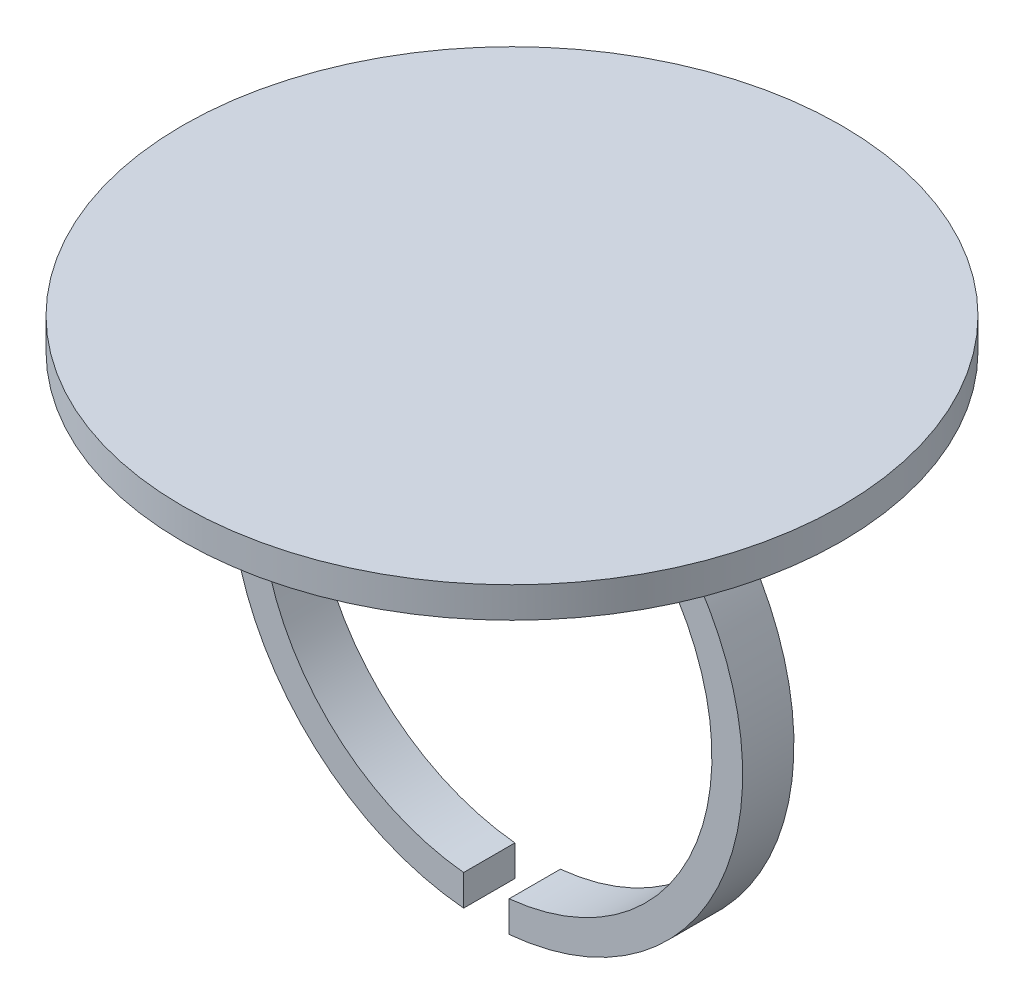
ISO-10303-21;
HEADER;
FILE_DESCRIPTION(('STEP AP214'),'2;1');
FILE_NAME('part.step','',(''),(''),'','','');
FILE_SCHEMA(('AUTOMOTIVE_DESIGN { 1 0 10303 214 1 1 1 1 }'));
ENDSEC;
DATA;
#1=APPLICATION_CONTEXT('core data for automotive mechanical design processes');
#2=APPLICATION_PROTOCOL_DEFINITION('international standard','automotive_design',2000,#1);
#3=PRODUCT_CONTEXT('',#1,'mechanical');
#4=PRODUCT('Part','Part','',(#3));
#5=PRODUCT_RELATED_PRODUCT_CATEGORY('part','',(#4));
#6=PRODUCT_DEFINITION_FORMATION('','',#4);
#7=PRODUCT_DEFINITION_CONTEXT('part definition',#1,'design');
#8=PRODUCT_DEFINITION('design','',#6,#7);
#9=PRODUCT_DEFINITION_SHAPE('','',#8);
#10=(LENGTH_UNIT() NAMED_UNIT(*) SI_UNIT(.MILLI.,.METRE.));
#11=(NAMED_UNIT(*) PLANE_ANGLE_UNIT() SI_UNIT($,.RADIAN.));
#12=(NAMED_UNIT(*) SI_UNIT($,.STERADIAN.) SOLID_ANGLE_UNIT());
#13=UNCERTAINTY_MEASURE_WITH_UNIT(LENGTH_MEASURE(1.E-05),#10,'distance_accuracy_value','');
#14=(GEOMETRIC_REPRESENTATION_CONTEXT(3) GLOBAL_UNCERTAINTY_ASSIGNED_CONTEXT((#13)) GLOBAL_UNIT_ASSIGNED_CONTEXT((#10,
#11,#12)) REPRESENTATION_CONTEXT('',''));
#15=CARTESIAN_POINT('',(0.,0.,0.));
#16=DIRECTION('',(0.,0.,1.));
#17=DIRECTION('',(1.,0.,0.));
#18=AXIS2_PLACEMENT_3D('',#15,#16,#17);
#19=CARTESIAN_POINT('',(0.,-22.,-2.5));
#20=DIRECTION('',(0.,0.,1.));
#21=DIRECTION('',(1.,0.,0.));
#22=AXIS2_PLACEMENT_3D('',#19,#20,#21);
#23=CYLINDRICAL_SURFACE('',#22,25.);
#24=DIRECTION('',(0.,0.,1.));
#25=VECTOR('',#24,1.);
#26=CARTESIAN_POINT('',(2.21915215242063,-46.9013124899955,-2.5));
#27=LINE('',#26,#25);
#28=CARTESIAN_POINT('',(2.21915215242063,-46.9013124899955,-2.5));
#29=VERTEX_POINT('',#28);
#30=CARTESIAN_POINT('',(2.21915215242063,-46.9013124899955,2.5));
#31=VERTEX_POINT('',#30);
#32=EDGE_CURVE('E89',#29,#31,#27,.T.);
#33=ORIENTED_EDGE('',*,*,#32,.F.);
#34=CARTESIAN_POINT('',(0.,-22.,-2.5));
#35=DIRECTION('',(0.,0.,1.));
#36=DIRECTION('',(1.,0.,0.));
#37=AXIS2_PLACEMENT_3D('',#34,#35,#36);
#38=CIRCLE('',#37,25.);
#39=CARTESIAN_POINT('',(11.8743420870379,0.,-2.5));
#40=VERTEX_POINT('',#39);
#41=EDGE_CURVE('E114',#29,#40,#38,.T.);
#42=ORIENTED_EDGE('',*,*,#41,.T.);
#43=DIRECTION('',(0.,0.,1.));
#44=VECTOR('',#43,1.);
#45=CARTESIAN_POINT('',(11.8743420870379,0.,-2.5));
#46=LINE('',#45,#44);
#47=CARTESIAN_POINT('',(11.8743420870379,0.,2.5));
#48=VERTEX_POINT('',#47);
#49=EDGE_CURVE('E109',#48,#40,#46,.F.);
#50=ORIENTED_EDGE('',*,*,#49,.F.);
#51=CARTESIAN_POINT('',(0.,-22.,2.5));
#52=DIRECTION('',(0.,0.,1.));
#53=DIRECTION('',(1.,0.,0.));
#54=AXIS2_PLACEMENT_3D('',#51,#52,#53);
#55=CIRCLE('',#54,25.);
#56=EDGE_CURVE('E103',#31,#48,#55,.T.);
#57=ORIENTED_EDGE('',*,*,#56,.F.);
#58=EDGE_LOOP('',(#33,#42,#50,#57));
#59=FACE_BOUND('',#58,.T.);
#60=ADVANCED_FACE('F33',(#59),#23,.T.);
#61=CARTESIAN_POINT('',(0.,-22.,-2.5));
#62=DIRECTION('',(0.,0.,1.));
#63=DIRECTION('',(1.,0.,0.));
#64=AXIS2_PLACEMENT_3D('',#61,#62,#63);
#65=PLANE('',#64);
#66=ORIENTED_EDGE('',*,*,#41,.F.);
#67=DIRECTION('',(0.,1.,0.));
#68=VECTOR('',#67,1.);
#69=CARTESIAN_POINT('',(2.21915215242063,-41.7243221290988,-2.5));
#70=LINE('',#69,#68);
#71=CARTESIAN_POINT('',(2.21915215242063,-43.8877902887525,-2.5));
#72=VERTEX_POINT('',#71);
#73=EDGE_CURVE('E92',#29,#72,#70,.T.);
#74=ORIENTED_EDGE('',*,*,#73,.T.);
#75=CARTESIAN_POINT('',(0.,-22.,-2.5));
#76=DIRECTION('',(0.,0.,1.));
#77=DIRECTION('',(1.,0.,0.));
#78=AXIS2_PLACEMENT_3D('',#75,#76,#77);
#79=CIRCLE('',#78,22.);
#80=CARTESIAN_POINT('',(0.,0.,-2.5));
#81=VERTEX_POINT('',#80);
#82=EDGE_CURVE('E116',#72,#81,#79,.T.);
#83=ORIENTED_EDGE('',*,*,#82,.T.);
#84=DIRECTION('',(1.,0.,0.));
#85=VECTOR('',#84,1.);
#86=CARTESIAN_POINT('',(0.,0.,-2.5));
#87=LINE('',#86,#85);
#88=EDGE_CURVE('E138',#81,#40,#87,.T.);
#89=ORIENTED_EDGE('',*,*,#88,.T.);
#90=EDGE_LOOP('',(#66,#74,#83,#89));
#91=FACE_BOUND('',#90,.T.);
#92=ADVANCED_FACE('F157',(#91),#65,.F.);
#93=CARTESIAN_POINT('',(0.,-22.,2.5));
#94=DIRECTION('',(0.,0.,1.));
#95=DIRECTION('',(1.,0.,0.));
#96=AXIS2_PLACEMENT_3D('',#93,#94,#95);
#97=PLANE('',#96);
#98=DIRECTION('',(0.,1.,0.));
#99=VECTOR('',#98,1.);
#100=CARTESIAN_POINT('',(2.21915215242063,-41.7243221290988,2.5));
#101=LINE('',#100,#99);
#102=CARTESIAN_POINT('',(2.21915215242063,-43.8877902887525,2.5));
#103=VERTEX_POINT('',#102);
#104=EDGE_CURVE('E48',#31,#103,#101,.T.);
#105=ORIENTED_EDGE('',*,*,#104,.F.);
#106=ORIENTED_EDGE('',*,*,#56,.T.);
#107=DIRECTION('',(1.,0.,0.));
#108=VECTOR('',#107,1.);
#109=CARTESIAN_POINT('',(0.,0.,2.5));
#110=LINE('',#109,#108);
#111=CARTESIAN_POINT('',(0.,0.,2.5));
#112=VERTEX_POINT('',#111);
#113=EDGE_CURVE('E128',#112,#48,#110,.T.);
#114=ORIENTED_EDGE('',*,*,#113,.F.);
#115=CARTESIAN_POINT('',(0.,-22.,2.5));
#116=DIRECTION('',(0.,0.,1.));
#117=DIRECTION('',(1.,0.,0.));
#118=AXIS2_PLACEMENT_3D('',#115,#116,#117);
#119=CIRCLE('',#118,22.);
#120=EDGE_CURVE('E96',#103,#112,#119,.T.);
#121=ORIENTED_EDGE('',*,*,#120,.F.);
#122=EDGE_LOOP('',(#105,#106,#114,#121));
#123=FACE_BOUND('',#122,.T.);
#124=ADVANCED_FACE('F101',(#123),#97,.T.);
#125=CARTESIAN_POINT('',(0.,0.,0.));
#126=DIRECTION('',(0.,1.,0.));
#127=DIRECTION('',(0.,0.,1.));
#128=AXIS2_PLACEMENT_3D('',#125,#126,#127);
#129=PLANE('',#128);
#130=CARTESIAN_POINT('',(0.,0.,0.));
#131=DIRECTION('',(0.,1.,0.));
#132=DIRECTION('',(0.,0.,1.));
#133=AXIS2_PLACEMENT_3D('',#130,#131,#132);
#134=CIRCLE('',#133,32.1391290666597);
#135=CARTESIAN_POINT('',(0.,0.,32.1391290666597));
#136=VERTEX_POINT('',#135);
#137=EDGE_CURVE('E124',#136,#136,#134,.T.);
#138=ORIENTED_EDGE('',*,*,#137,.F.);
#139=EDGE_LOOP('',(#138));
#140=FACE_BOUND('',#139,.T.);
#141=CARTESIAN_POINT('',(-11.8743420870379,0.,-2.5));
#142=VERTEX_POINT('',#141);
#143=EDGE_CURVE('E139',#142,#81,#87,.T.);
#144=ORIENTED_EDGE('',*,*,#143,.F.);
#145=DIRECTION('',(0.,0.,1.));
#146=VECTOR('',#145,1.);
#147=CARTESIAN_POINT('',(-11.8743420870379,0.,-2.5));
#148=LINE('',#147,#146);
#149=CARTESIAN_POINT('',(-11.8743420870379,0.,2.5));
#150=VERTEX_POINT('',#149);
#151=EDGE_CURVE('E135',#142,#150,#148,.T.);
#152=ORIENTED_EDGE('',*,*,#151,.T.);
#153=EDGE_CURVE('E131',#150,#112,#110,.T.);
#154=ORIENTED_EDGE('',*,*,#153,.T.);
#155=ORIENTED_EDGE('',*,*,#113,.T.);
#156=ORIENTED_EDGE('',*,*,#49,.T.);
#157=ORIENTED_EDGE('',*,*,#88,.F.);
#158=EDGE_LOOP('',(#144,#152,#154,#155,#156,#157));
#159=FACE_BOUND('',#158,.T.);
#160=ADVANCED_FACE('F154',(#140,#159),#129,.F.);
#161=CARTESIAN_POINT('',(0.,3.,0.));
#162=DIRECTION('',(0.,-1.,0.));
#163=DIRECTION('',(0.,0.,-1.));
#164=AXIS2_PLACEMENT_3D('',#161,#162,#163);
#165=CYLINDRICAL_SURFACE('',#164,32.1391290666597);
#166=CARTESIAN_POINT('',(0.,3.,0.));
#167=DIRECTION('',(0.,1.,0.));
#168=DIRECTION('',(0.,0.,1.));
#169=AXIS2_PLACEMENT_3D('',#166,#167,#168);
#170=CIRCLE('',#169,32.1391290666597);
#171=CARTESIAN_POINT('',(0.,3.,32.1391290666597));
#172=VERTEX_POINT('',#171);
#173=EDGE_CURVE('E125',#172,#172,#170,.T.);
#174=ORIENTED_EDGE('',*,*,#173,.F.);
#175=EDGE_LOOP('',(#174));
#176=FACE_BOUND('',#175,.T.);
#177=ORIENTED_EDGE('',*,*,#137,.T.);
#178=EDGE_LOOP('',(#177));
#179=FACE_BOUND('',#178,.T.);
#180=ADVANCED_FACE('F35',(#176,#179),#165,.T.);
#181=CARTESIAN_POINT('',(0.,3.,0.));
#182=DIRECTION('',(0.,1.,0.));
#183=DIRECTION('',(0.,0.,1.));
#184=AXIS2_PLACEMENT_3D('',#181,#182,#183);
#185=PLANE('',#184);
#186=ORIENTED_EDGE('',*,*,#173,.T.);
#187=EDGE_LOOP('',(#186));
#188=FACE_BOUND('',#187,.T.);
#189=ADVANCED_FACE('F185',(#188),#185,.T.);
#190=DIRECTION('',(0.,0.,1.));
#191=VECTOR('',#190,1.);
#192=CARTESIAN_POINT('',(-2.21915215242063,-46.9013124899955,-2.5));
#193=LINE('',#192,#191);
#194=CARTESIAN_POINT('',(-2.21915215242063,-46.9013124899955,2.5));
#195=VERTEX_POINT('',#194);
#196=CARTESIAN_POINT('',(-2.21915215242063,-46.9013124899955,-2.5));
#197=VERTEX_POINT('',#196);
#198=EDGE_CURVE('E97',#195,#197,#193,.F.);
#199=ORIENTED_EDGE('',*,*,#198,.F.);
#200=EDGE_CURVE('E110',#150,#195,#55,.T.);
#201=ORIENTED_EDGE('',*,*,#200,.F.);
#202=ORIENTED_EDGE('',*,*,#151,.F.);
#203=EDGE_CURVE('E121',#142,#197,#38,.T.);
#204=ORIENTED_EDGE('',*,*,#203,.T.);
#205=EDGE_LOOP('',(#199,#201,#202,#204));
#206=FACE_BOUND('',#205,.T.);
#207=ADVANCED_FACE('F167',(#206),#23,.T.);
#208=CARTESIAN_POINT('',(-2.21915215242063,-43.8877902887525,-2.5));
#209=VERTEX_POINT('',#208);
#210=EDGE_CURVE('E111',#81,#209,#79,.T.);
#211=ORIENTED_EDGE('',*,*,#210,.T.);
#212=DIRECTION('',(0.,-1.,0.));
#213=VECTOR('',#212,1.);
#214=CARTESIAN_POINT('',(-2.21915215242063,-41.7243221290988,-2.5));
#215=LINE('',#214,#213);
#216=EDGE_CURVE('E55',#209,#197,#215,.T.);
#217=ORIENTED_EDGE('',*,*,#216,.T.);
#218=ORIENTED_EDGE('',*,*,#203,.F.);
#219=ORIENTED_EDGE('',*,*,#143,.T.);
#220=EDGE_LOOP('',(#211,#217,#218,#219));
#221=FACE_BOUND('',#220,.T.);
#222=ADVANCED_FACE('F150',(#221),#65,.F.);
#223=DIRECTION('',(0.,-1.,0.));
#224=VECTOR('',#223,1.);
#225=CARTESIAN_POINT('',(-2.21915215242063,-41.7243221290988,2.5));
#226=LINE('',#225,#224);
#227=CARTESIAN_POINT('',(-2.21915215242063,-43.8877902887525,2.5));
#228=VERTEX_POINT('',#227);
#229=EDGE_CURVE('E105',#228,#195,#226,.T.);
#230=ORIENTED_EDGE('',*,*,#229,.F.);
#231=EDGE_CURVE('E120',#112,#228,#119,.T.);
#232=ORIENTED_EDGE('',*,*,#231,.F.);
#233=ORIENTED_EDGE('',*,*,#153,.F.);
#234=ORIENTED_EDGE('',*,*,#200,.T.);
#235=EDGE_LOOP('',(#230,#232,#233,#234));
#236=FACE_BOUND('',#235,.T.);
#237=ADVANCED_FACE('F168',(#236),#97,.T.);
#238=CARTESIAN_POINT('',(0.,-22.,-2.5));
#239=DIRECTION('',(0.,0.,1.));
#240=DIRECTION('',(1.,0.,0.));
#241=AXIS2_PLACEMENT_3D('',#238,#239,#240);
#242=CYLINDRICAL_SURFACE('',#241,22.);
#243=ORIENTED_EDGE('',*,*,#82,.F.);
#244=DIRECTION('',(0.,0.,1.));
#245=VECTOR('',#244,1.);
#246=CARTESIAN_POINT('',(2.21915215242063,-43.8877902887525,-2.5));
#247=LINE('',#246,#245);
#248=EDGE_CURVE('E11',#72,#103,#247,.T.);
#249=ORIENTED_EDGE('',*,*,#248,.T.);
#250=ORIENTED_EDGE('',*,*,#120,.T.);
#251=ORIENTED_EDGE('',*,*,#231,.T.);
#252=DIRECTION('',(0.,0.,1.));
#253=VECTOR('',#252,1.);
#254=CARTESIAN_POINT('',(-2.21915215242063,-43.8877902887525,-2.5));
#255=LINE('',#254,#253);
#256=EDGE_CURVE('E41',#228,#209,#255,.F.);
#257=ORIENTED_EDGE('',*,*,#256,.T.);
#258=ORIENTED_EDGE('',*,*,#210,.F.);
#259=EDGE_LOOP('',(#243,#249,#250,#251,#257,#258));
#260=FACE_BOUND('',#259,.T.);
#261=ADVANCED_FACE('F145',(#260),#242,.F.);
#262=CARTESIAN_POINT('',(-2.21915215242063,-41.7243221290988,-2.5));
#263=DIRECTION('',(-1.,0.,0.));
#264=DIRECTION('',(0.,0.,1.));
#265=AXIS2_PLACEMENT_3D('',#262,#263,#264);
#266=PLANE('',#265);
#267=ORIENTED_EDGE('',*,*,#198,.T.);
#268=ORIENTED_EDGE('',*,*,#216,.F.);
#269=ORIENTED_EDGE('',*,*,#256,.F.);
#270=ORIENTED_EDGE('',*,*,#229,.T.);
#271=EDGE_LOOP('',(#267,#268,#269,#270));
#272=FACE_BOUND('',#271,.T.);
#273=ADVANCED_FACE('F163',(#272),#266,.F.);
#274=CARTESIAN_POINT('',(2.21915215242063,-41.7243221290988,-2.5));
#275=DIRECTION('',(1.,0.,0.));
#276=DIRECTION('',(0.,0.,-1.));
#277=AXIS2_PLACEMENT_3D('',#274,#275,#276);
#278=PLANE('',#277);
#279=ORIENTED_EDGE('',*,*,#32,.T.);
#280=ORIENTED_EDGE('',*,*,#104,.T.);
#281=ORIENTED_EDGE('',*,*,#248,.F.);
#282=ORIENTED_EDGE('',*,*,#73,.F.);
#283=EDGE_LOOP('',(#279,#280,#281,#282));
#284=FACE_BOUND('',#283,.T.);
#285=ADVANCED_FACE('F90',(#284),#278,.F.);
#286=CLOSED_SHELL('',(#60,#92,#124,#160,#180,#189,#207,#222,#237,#261,#273,#285));
#287=MANIFOLD_SOLID_BREP('B2',#286);
#288=ADVANCED_BREP_SHAPE_REPRESENTATION('',(#18,#287),#14);
#289=SHAPE_DEFINITION_REPRESENTATION(#9,#288);
ENDSEC;
END-ISO-10303-21;
